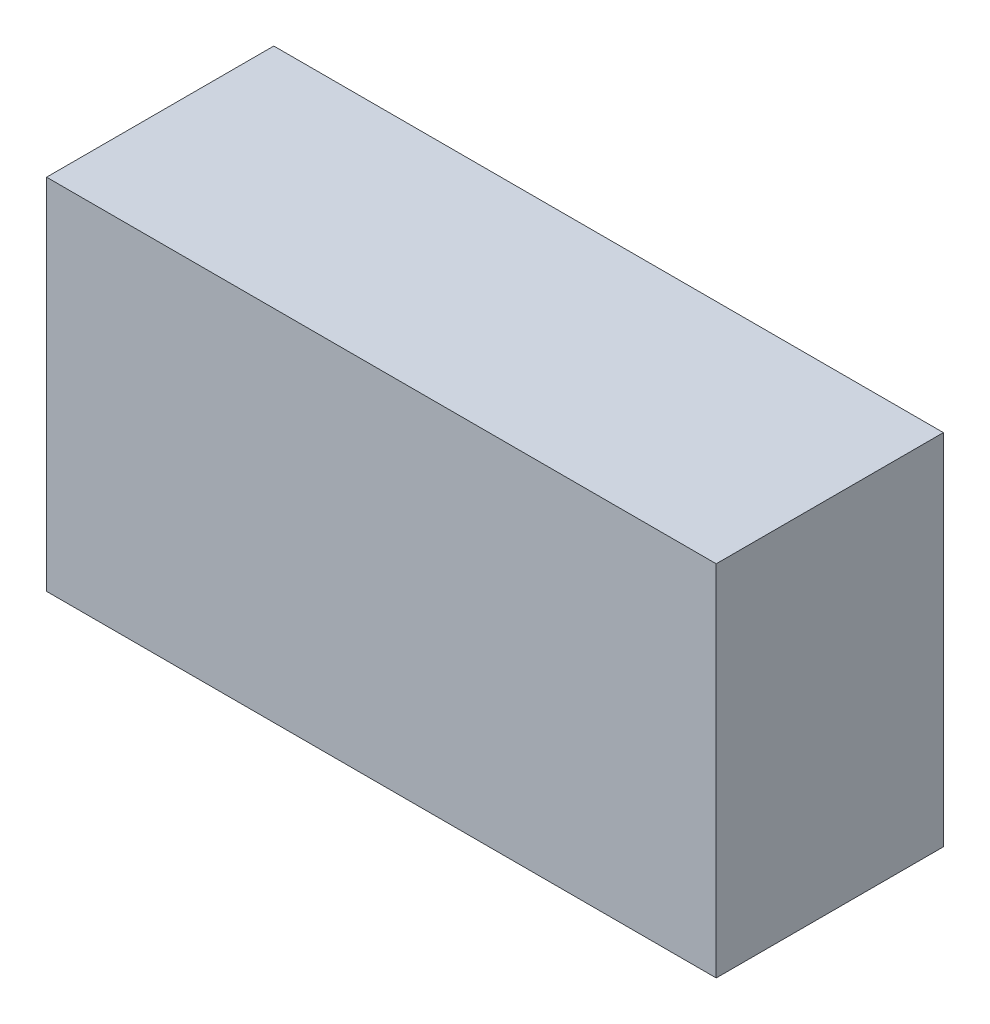
ISO-10303-21;
HEADER;
FILE_DESCRIPTION(('STEP AP214'),'2;1');
FILE_NAME('part.step','',(''),(''),'','','');
FILE_SCHEMA(('AUTOMOTIVE_DESIGN { 1 0 10303 214 1 1 1 1 }'));
ENDSEC;
DATA;
#1=APPLICATION_CONTEXT('core data for automotive mechanical design processes');
#2=APPLICATION_PROTOCOL_DEFINITION('international standard','automotive_design',2000,#1);
#3=PRODUCT_CONTEXT('',#1,'mechanical');
#4=PRODUCT('Part','Part','',(#3));
#5=PRODUCT_RELATED_PRODUCT_CATEGORY('part','',(#4));
#6=PRODUCT_DEFINITION_FORMATION('','',#4);
#7=PRODUCT_DEFINITION_CONTEXT('part definition',#1,'design');
#8=PRODUCT_DEFINITION('design','',#6,#7);
#9=PRODUCT_DEFINITION_SHAPE('','',#8);
#10=(LENGTH_UNIT() NAMED_UNIT(*) SI_UNIT(.MILLI.,.METRE.));
#11=(NAMED_UNIT(*) PLANE_ANGLE_UNIT() SI_UNIT($,.RADIAN.));
#12=(NAMED_UNIT(*) SI_UNIT($,.STERADIAN.) SOLID_ANGLE_UNIT());
#13=UNCERTAINTY_MEASURE_WITH_UNIT(LENGTH_MEASURE(1.E-05),#10,'distance_accuracy_value','');
#14=(GEOMETRIC_REPRESENTATION_CONTEXT(3) GLOBAL_UNCERTAINTY_ASSIGNED_CONTEXT((#13)) GLOBAL_UNIT_ASSIGNED_CONTEXT((#10,
#11,#12)) REPRESENTATION_CONTEXT('',''));
#15=CARTESIAN_POINT('',(0.,0.,0.));
#16=DIRECTION('',(0.,0.,1.));
#17=DIRECTION('',(1.,0.,0.));
#18=AXIS2_PLACEMENT_3D('',#15,#16,#17);
#19=CARTESIAN_POINT('',(10.7442,5.12318,0.81916));
#20=DIRECTION('',(0.,0.,1.));
#21=DIRECTION('',(1.,0.,0.));
#22=AXIS2_PLACEMENT_3D('',#19,#20,#21);
#23=PLANE('',#22);
#24=DIRECTION('',(0.,1.,0.));
#25=VECTOR('',#24,1.);
#26=CARTESIAN_POINT('',(10.4642,5.27318,0.81916));
#27=LINE('',#26,#25);
#28=CARTESIAN_POINT('',(10.4642,4.97318,0.81916));
#29=VERTEX_POINT('',#28);
#30=CARTESIAN_POINT('',(10.4642,5.27318,0.81916));
#31=VERTEX_POINT('',#30);
#32=EDGE_CURVE('E81',#29,#31,#27,.T.);
#33=ORIENTED_EDGE('',*,*,#32,.T.);
#34=DIRECTION('',(1.,0.,0.));
#35=VECTOR('',#34,1.);
#36=CARTESIAN_POINT('',(11.0242,5.27318,0.81916));
#37=LINE('',#36,#35);
#38=CARTESIAN_POINT('',(11.0242,5.27318,0.81916));
#39=VERTEX_POINT('',#38);
#40=EDGE_CURVE('E68',#31,#39,#37,.T.);
#41=ORIENTED_EDGE('',*,*,#40,.T.);
#42=DIRECTION('',(0.,1.,0.));
#43=VECTOR('',#42,1.);
#44=CARTESIAN_POINT('',(11.0242,5.27318,0.81916));
#45=LINE('',#44,#43);
#46=CARTESIAN_POINT('',(11.0242,4.97318,0.81916));
#47=VERTEX_POINT('',#46);
#48=EDGE_CURVE('E55',#39,#47,#45,.F.);
#49=ORIENTED_EDGE('',*,*,#48,.T.);
#50=DIRECTION('',(1.,0.,0.));
#51=VECTOR('',#50,1.);
#52=CARTESIAN_POINT('',(11.0242,4.97318,0.81916));
#53=LINE('',#52,#51);
#54=EDGE_CURVE('E20',#47,#29,#53,.F.);
#55=ORIENTED_EDGE('',*,*,#54,.T.);
#56=EDGE_LOOP('',(#33,#41,#49,#55));
#57=FACE_BOUND('',#56,.T.);
#58=ADVANCED_FACE('F17',(#57),#23,.F.);
#59=CARTESIAN_POINT('',(11.0242,4.97318,1.00916));
#60=DIRECTION('',(0.,1.,0.));
#61=DIRECTION('',(0.,0.,1.));
#62=AXIS2_PLACEMENT_3D('',#59,#60,#61);
#63=PLANE('',#62);
#64=DIRECTION('',(0.,0.,1.));
#65=VECTOR('',#64,1.);
#66=CARTESIAN_POINT('',(11.0242,4.97318,1.00916));
#67=LINE('',#66,#65);
#68=CARTESIAN_POINT('',(11.0242,4.97318,1.00916));
#69=VERTEX_POINT('',#68);
#70=EDGE_CURVE('E61',#47,#69,#67,.T.);
#71=ORIENTED_EDGE('',*,*,#70,.T.);
#72=DIRECTION('',(1.,0.,0.));
#73=VECTOR('',#72,1.);
#74=CARTESIAN_POINT('',(10.7442,4.97318,1.00916));
#75=LINE('',#74,#73);
#76=CARTESIAN_POINT('',(10.4642,4.97318,1.00916));
#77=VERTEX_POINT('',#76);
#78=EDGE_CURVE('E83',#77,#69,#75,.T.);
#79=ORIENTED_EDGE('',*,*,#78,.F.);
#80=DIRECTION('',(0.,0.,-1.));
#81=VECTOR('',#80,1.);
#82=CARTESIAN_POINT('',(10.4642,4.97318,1.00916));
#83=LINE('',#82,#81);
#84=EDGE_CURVE('E64',#77,#29,#83,.T.);
#85=ORIENTED_EDGE('',*,*,#84,.T.);
#86=ORIENTED_EDGE('',*,*,#54,.F.);
#87=EDGE_LOOP('',(#71,#79,#85,#86));
#88=FACE_BOUND('',#87,.T.);
#89=ADVANCED_FACE('F60',(#88),#63,.F.);
#90=CARTESIAN_POINT('',(11.0242,5.27318,1.00916));
#91=DIRECTION('',(-1.,0.,0.));
#92=DIRECTION('',(0.,0.,1.));
#93=AXIS2_PLACEMENT_3D('',#90,#91,#92);
#94=PLANE('',#93);
#95=DIRECTION('',(0.,0.,-1.));
#96=VECTOR('',#95,1.);
#97=CARTESIAN_POINT('',(11.0242,5.27318,1.00916));
#98=LINE('',#97,#96);
#99=CARTESIAN_POINT('',(11.0242,5.27318,1.00916));
#100=VERTEX_POINT('',#99);
#101=EDGE_CURVE('E70',#39,#100,#98,.F.);
#102=ORIENTED_EDGE('',*,*,#101,.T.);
#103=DIRECTION('',(0.,1.,0.));
#104=VECTOR('',#103,1.);
#105=CARTESIAN_POINT('',(11.0242,5.12318,1.00916));
#106=LINE('',#105,#104);
#107=EDGE_CURVE('E74',#69,#100,#106,.T.);
#108=ORIENTED_EDGE('',*,*,#107,.F.);
#109=ORIENTED_EDGE('',*,*,#70,.F.);
#110=ORIENTED_EDGE('',*,*,#48,.F.);
#111=EDGE_LOOP('',(#102,#108,#109,#110));
#112=FACE_BOUND('',#111,.T.);
#113=ADVANCED_FACE('F72',(#112),#94,.F.);
#114=CARTESIAN_POINT('',(11.0242,5.27318,1.00916));
#115=DIRECTION('',(0.,-1.,0.));
#116=DIRECTION('',(0.,0.,-1.));
#117=AXIS2_PLACEMENT_3D('',#114,#115,#116);
#118=PLANE('',#117);
#119=DIRECTION('',(0.,0.,-1.));
#120=VECTOR('',#119,1.);
#121=CARTESIAN_POINT('',(10.4642,5.27318,1.00916));
#122=LINE('',#121,#120);
#123=CARTESIAN_POINT('',(10.4642,5.27318,1.00916));
#124=VERTEX_POINT('',#123);
#125=EDGE_CURVE('E35',#31,#124,#122,.F.);
#126=ORIENTED_EDGE('',*,*,#125,.T.);
#127=DIRECTION('',(1.,0.,0.));
#128=VECTOR('',#127,1.);
#129=CARTESIAN_POINT('',(10.7442,5.27318,1.00916));
#130=LINE('',#129,#128);
#131=EDGE_CURVE('E26',#100,#124,#130,.F.);
#132=ORIENTED_EDGE('',*,*,#131,.F.);
#133=ORIENTED_EDGE('',*,*,#101,.F.);
#134=ORIENTED_EDGE('',*,*,#40,.F.);
#135=EDGE_LOOP('',(#126,#132,#133,#134));
#136=FACE_BOUND('',#135,.T.);
#137=ADVANCED_FACE('F89',(#136),#118,.F.);
#138=CARTESIAN_POINT('',(10.4642,5.27318,1.00916));
#139=DIRECTION('',(1.,0.,0.));
#140=DIRECTION('',(0.,0.,-1.));
#141=AXIS2_PLACEMENT_3D('',#138,#139,#140);
#142=PLANE('',#141);
#143=ORIENTED_EDGE('',*,*,#84,.F.);
#144=DIRECTION('',(0.,1.,0.));
#145=VECTOR('',#144,1.);
#146=CARTESIAN_POINT('',(10.4642,5.12318,1.00916));
#147=LINE('',#146,#145);
#148=EDGE_CURVE('E11',#124,#77,#147,.F.);
#149=ORIENTED_EDGE('',*,*,#148,.F.);
#150=ORIENTED_EDGE('',*,*,#125,.F.);
#151=ORIENTED_EDGE('',*,*,#32,.F.);
#152=EDGE_LOOP('',(#143,#149,#150,#151));
#153=FACE_BOUND('',#152,.T.);
#154=ADVANCED_FACE('F91',(#153),#142,.F.);
#155=CARTESIAN_POINT('',(10.7442,5.12318,1.00916));
#156=DIRECTION('',(0.,0.,1.));
#157=DIRECTION('',(1.,0.,0.));
#158=AXIS2_PLACEMENT_3D('',#155,#156,#157);
#159=PLANE('',#158);
#160=ORIENTED_EDGE('',*,*,#131,.T.);
#161=ORIENTED_EDGE('',*,*,#148,.T.);
#162=ORIENTED_EDGE('',*,*,#78,.T.);
#163=ORIENTED_EDGE('',*,*,#107,.T.);
#164=EDGE_LOOP('',(#160,#161,#162,#163));
#165=FACE_BOUND('',#164,.T.);
#166=ADVANCED_FACE('F88',(#165),#159,.T.);
#167=CLOSED_SHELL('',(#58,#89,#113,#137,#154,#166));
#168=MANIFOLD_SOLID_BREP('B1',#167);
#169=ADVANCED_BREP_SHAPE_REPRESENTATION('',(#18,#168),#14);
#170=SHAPE_DEFINITION_REPRESENTATION(#9,#169);
ENDSEC;
END-ISO-10303-21;
